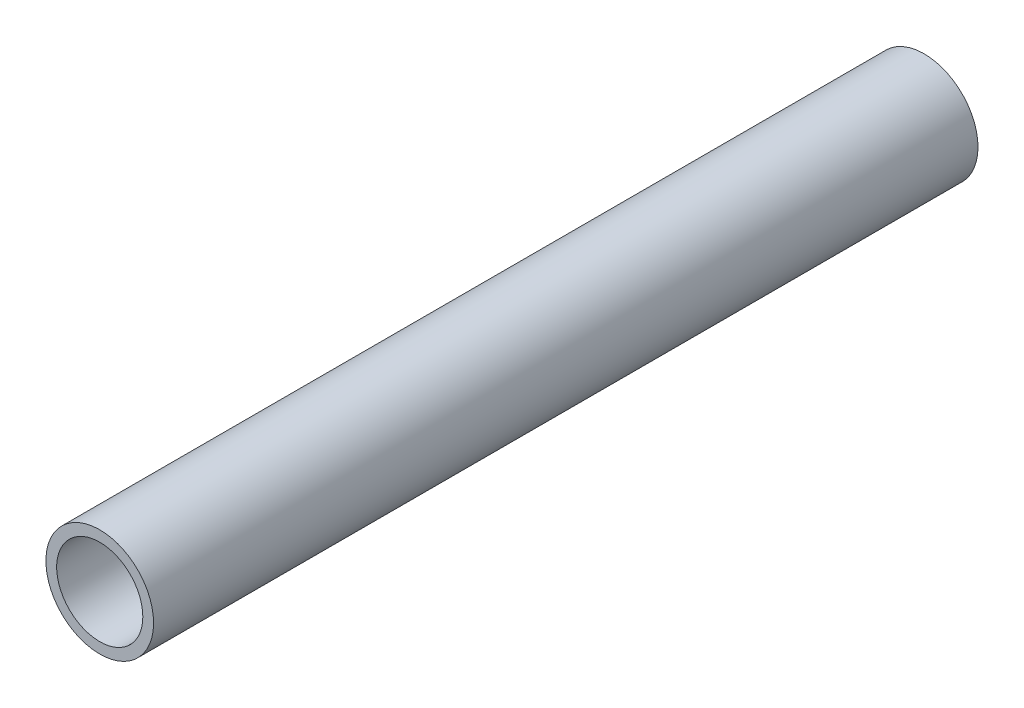
ISO-10303-21;
HEADER;
FILE_DESCRIPTION(('STEP AP214'),'2;1');
FILE_NAME('part.step','',(''),(''),'','','');
FILE_SCHEMA(('AUTOMOTIVE_DESIGN { 1 0 10303 214 1 1 1 1 }'));
ENDSEC;
DATA;
#1=APPLICATION_CONTEXT('core data for automotive mechanical design processes');
#2=APPLICATION_PROTOCOL_DEFINITION('international standard','automotive_design',2000,#1);
#3=PRODUCT_CONTEXT('',#1,'mechanical');
#4=PRODUCT('Part','Part','',(#3));
#5=PRODUCT_RELATED_PRODUCT_CATEGORY('part','',(#4));
#6=PRODUCT_DEFINITION_FORMATION('','',#4);
#7=PRODUCT_DEFINITION_CONTEXT('part definition',#1,'design');
#8=PRODUCT_DEFINITION('design','',#6,#7);
#9=PRODUCT_DEFINITION_SHAPE('','',#8);
#10=(LENGTH_UNIT() NAMED_UNIT(*) SI_UNIT(.MILLI.,.METRE.));
#11=(NAMED_UNIT(*) PLANE_ANGLE_UNIT() SI_UNIT($,.RADIAN.));
#12=(NAMED_UNIT(*) SI_UNIT($,.STERADIAN.) SOLID_ANGLE_UNIT());
#13=UNCERTAINTY_MEASURE_WITH_UNIT(LENGTH_MEASURE(1.E-05),#10,'distance_accuracy_value','');
#14=(GEOMETRIC_REPRESENTATION_CONTEXT(3) GLOBAL_UNCERTAINTY_ASSIGNED_CONTEXT((#13)) GLOBAL_UNIT_ASSIGNED_CONTEXT((#10,
#11,#12)) REPRESENTATION_CONTEXT('',''));
#15=CARTESIAN_POINT('',(0.,0.,0.));
#16=DIRECTION('',(0.,0.,1.));
#17=DIRECTION('',(1.,0.,0.));
#18=AXIS2_PLACEMENT_3D('',#15,#16,#17);
#19=CARTESIAN_POINT('',(0.,0.,19.14));
#20=DIRECTION('',(0.,0.,1.));
#21=DIRECTION('',(1.,0.,0.));
#22=AXIS2_PLACEMENT_3D('',#19,#20,#21);
#23=PLANE('',#22);
#24=CARTESIAN_POINT('',(0.,0.,19.14));
#25=DIRECTION('',(0.,0.,1.));
#26=DIRECTION('',(1.,0.,0.));
#27=AXIS2_PLACEMENT_3D('',#24,#25,#26);
#28=CIRCLE('',#27,1.25);
#29=CARTESIAN_POINT('',(1.25,0.,19.14));
#30=VERTEX_POINT('',#29);
#31=EDGE_CURVE('E10',#30,#30,#28,.T.);
#32=ORIENTED_EDGE('',*,*,#31,.T.);
#33=EDGE_LOOP('',(#32));
#34=FACE_BOUND('',#33,.T.);
#35=CARTESIAN_POINT('',(0.,0.,19.14));
#36=DIRECTION('',(0.,0.,1.));
#37=DIRECTION('',(1.,0.,0.));
#38=AXIS2_PLACEMENT_3D('',#35,#36,#37);
#39=CIRCLE('',#38,1.);
#40=CARTESIAN_POINT('',(1.,0.,19.14));
#41=VERTEX_POINT('',#40);
#42=EDGE_CURVE('E42',#41,#41,#39,.T.);
#43=ORIENTED_EDGE('',*,*,#42,.F.);
#44=EDGE_LOOP('',(#43));
#45=FACE_BOUND('',#44,.T.);
#46=ADVANCED_FACE('F31',(#34,#45),#23,.T.);
#47=CARTESIAN_POINT('',(0.,0.,0.));
#48=DIRECTION('',(0.,0.,1.));
#49=DIRECTION('',(1.,0.,0.));
#50=AXIS2_PLACEMENT_3D('',#47,#48,#49);
#51=PLANE('',#50);
#52=CARTESIAN_POINT('',(0.,0.,0.));
#53=DIRECTION('',(0.,0.,1.));
#54=DIRECTION('',(1.,0.,0.));
#55=AXIS2_PLACEMENT_3D('',#52,#53,#54);
#56=CIRCLE('',#55,1.25);
#57=CARTESIAN_POINT('',(1.25,0.,0.));
#58=VERTEX_POINT('',#57);
#59=EDGE_CURVE('E35',#58,#58,#56,.T.);
#60=ORIENTED_EDGE('',*,*,#59,.F.);
#61=EDGE_LOOP('',(#60));
#62=FACE_BOUND('',#61,.T.);
#63=CARTESIAN_POINT('',(0.,0.,0.));
#64=DIRECTION('',(0.,0.,1.));
#65=DIRECTION('',(1.,0.,0.));
#66=AXIS2_PLACEMENT_3D('',#63,#64,#65);
#67=CIRCLE('',#66,1.);
#68=CARTESIAN_POINT('',(1.,0.,0.));
#69=VERTEX_POINT('',#68);
#70=EDGE_CURVE('E44',#69,#69,#67,.T.);
#71=ORIENTED_EDGE('',*,*,#70,.T.);
#72=EDGE_LOOP('',(#71));
#73=FACE_BOUND('',#72,.T.);
#74=ADVANCED_FACE('F54',(#62,#73),#51,.F.);
#75=CARTESIAN_POINT('',(0.,0.,19.14));
#76=DIRECTION('',(0.,0.,-1.));
#77=DIRECTION('',(-1.,0.,0.));
#78=AXIS2_PLACEMENT_3D('',#75,#76,#77);
#79=CYLINDRICAL_SURFACE('',#78,1.25);
#80=ORIENTED_EDGE('',*,*,#31,.F.);
#81=EDGE_LOOP('',(#80));
#82=FACE_BOUND('',#81,.T.);
#83=ORIENTED_EDGE('',*,*,#59,.T.);
#84=EDGE_LOOP('',(#83));
#85=FACE_BOUND('',#84,.T.);
#86=ADVANCED_FACE('F33',(#82,#85),#79,.T.);
#87=CARTESIAN_POINT('',(0.,0.,19.14));
#88=DIRECTION('',(0.,0.,-1.));
#89=DIRECTION('',(-1.,0.,0.));
#90=AXIS2_PLACEMENT_3D('',#87,#88,#89);
#91=CYLINDRICAL_SURFACE('',#90,1.);
#92=ORIENTED_EDGE('',*,*,#42,.T.);
#93=EDGE_LOOP('',(#92));
#94=FACE_BOUND('',#93,.T.);
#95=ORIENTED_EDGE('',*,*,#70,.F.);
#96=EDGE_LOOP('',(#95));
#97=FACE_BOUND('',#96,.T.);
#98=ADVANCED_FACE('F50',(#94,#97),#91,.F.);
#99=CLOSED_SHELL('',(#46,#74,#86,#98));
#100=MANIFOLD_SOLID_BREP('B2',#99);
#101=ADVANCED_BREP_SHAPE_REPRESENTATION('',(#18,#100),#14);
#102=SHAPE_DEFINITION_REPRESENTATION(#9,#101);
ENDSEC;
END-ISO-10303-21;
